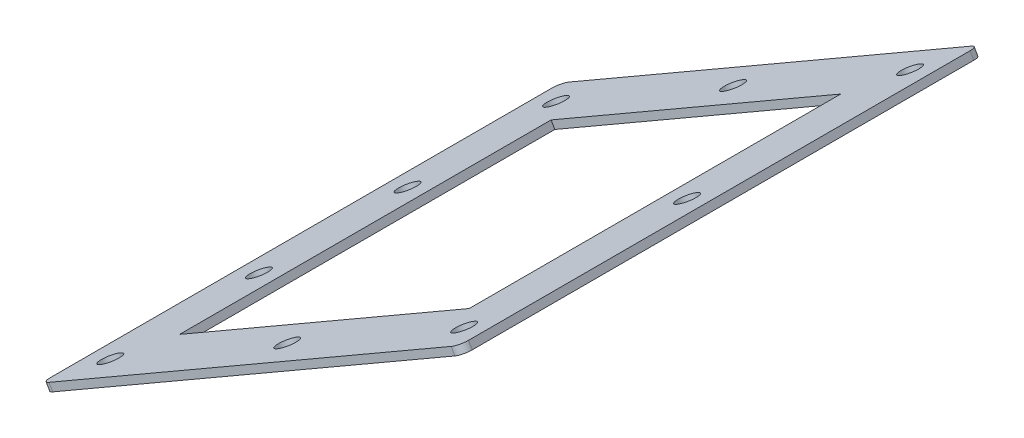
ISO-10303-21;
HEADER;
FILE_DESCRIPTION(('STEP AP214'),'2;1');
FILE_NAME('part.step','',(''),(''),'','','');
FILE_SCHEMA(('AUTOMOTIVE_DESIGN { 1 0 10303 214 1 1 1 1 }'));
ENDSEC;
DATA;
#1=APPLICATION_CONTEXT('core data for automotive mechanical design processes');
#2=APPLICATION_PROTOCOL_DEFINITION('international standard','automotive_design',2000,#1);
#3=PRODUCT_CONTEXT('',#1,'mechanical');
#4=PRODUCT('Part','Part','',(#3));
#5=PRODUCT_RELATED_PRODUCT_CATEGORY('part','',(#4));
#6=PRODUCT_DEFINITION_FORMATION('','',#4);
#7=PRODUCT_DEFINITION_CONTEXT('part definition',#1,'design');
#8=PRODUCT_DEFINITION('design','',#6,#7);
#9=PRODUCT_DEFINITION_SHAPE('','',#8);
#10=(LENGTH_UNIT() NAMED_UNIT(*) SI_UNIT(.MILLI.,.METRE.));
#11=(NAMED_UNIT(*) PLANE_ANGLE_UNIT() SI_UNIT($,.RADIAN.));
#12=(NAMED_UNIT(*) SI_UNIT($,.STERADIAN.) SOLID_ANGLE_UNIT());
#13=UNCERTAINTY_MEASURE_WITH_UNIT(LENGTH_MEASURE(1.E-05),#10,'distance_accuracy_value','');
#14=(GEOMETRIC_REPRESENTATION_CONTEXT(3) GLOBAL_UNCERTAINTY_ASSIGNED_CONTEXT((#13)) GLOBAL_UNIT_ASSIGNED_CONTEXT((#10,
#11,#12)) REPRESENTATION_CONTEXT('',''));
#15=CARTESIAN_POINT('',(0.,0.,0.));
#16=DIRECTION('',(0.,0.,1.));
#17=DIRECTION('',(1.,0.,0.));
#18=AXIS2_PLACEMENT_3D('',#15,#16,#17);
#19=CARTESIAN_POINT('',(-692.,3237.7,140.));
#20=DIRECTION('',(0.866025403784441,0.499999999999996,0.));
#21=DIRECTION('',(0.,0.,-1.));
#22=AXIS2_PLACEMENT_3D('',#19,#20,#21);
#23=PLANE('',#22);
#24=DIRECTION('',(0.,0.,1.));
#25=VECTOR('',#24,1.);
#26=CARTESIAN_POINT('',(-690.,3234.23589838486,140.));
#27=LINE('',#26,#25);
#28=CARTESIAN_POINT('',(-690.,3234.23589838486,135.));
#29=VERTEX_POINT('',#28);
#30=CARTESIAN_POINT('',(-690.,3234.23589838486,-135.));
#31=VERTEX_POINT('',#30);
#32=EDGE_CURVE('E222',#29,#31,#27,.F.);
#33=ORIENTED_EDGE('',*,*,#32,.F.);
#34=DIRECTION('',(-0.499999999999996,0.866025403784441,0.));
#35=VECTOR('',#34,1.);
#36=CARTESIAN_POINT('',(-692.,3237.7,135.));
#37=LINE('',#36,#35);
#38=CARTESIAN_POINT('',(-692.,3237.7,135.));
#39=VERTEX_POINT('',#38);
#40=EDGE_CURVE('E256',#29,#39,#37,.T.);
#41=ORIENTED_EDGE('',*,*,#40,.T.);
#42=DIRECTION('',(0.,0.,-1.));
#43=VECTOR('',#42,1.);
#44=CARTESIAN_POINT('',(-692.,3237.7,140.));
#45=LINE('',#44,#43);
#46=CARTESIAN_POINT('',(-692.,3237.7,-135.));
#47=VERTEX_POINT('',#46);
#48=EDGE_CURVE('E173',#39,#47,#45,.T.);
#49=ORIENTED_EDGE('',*,*,#48,.T.);
#50=DIRECTION('',(0.499999999999996,-0.866025403784441,0.));
#51=VECTOR('',#50,1.);
#52=CARTESIAN_POINT('',(-692.,3237.7,-135.));
#53=LINE('',#52,#51);
#54=EDGE_CURVE('E254',#47,#31,#53,.T.);
#55=ORIENTED_EDGE('',*,*,#54,.T.);
#56=EDGE_LOOP('',(#33,#41,#49,#55));
#57=FACE_BOUND('',#56,.T.);
#58=ADVANCED_FACE('F39',(#57),#23,.F.);
#59=CARTESIAN_POINT('',(-692.,3237.7,140.));
#60=DIRECTION('',(0.,0.,1.));
#61=DIRECTION('',(0.866025403784441,0.499999999999996,0.));
#62=AXIS2_PLACEMENT_3D('',#59,#60,#61);
#63=PLANE('',#62);
#64=DIRECTION('',(-0.866025403784441,-0.499999999999996,0.));
#65=VECTOR('',#64,1.);
#66=CARTESIAN_POINT('',(-690.,3234.23589838486,140.));
#67=LINE('',#66,#65);
#68=CARTESIAN_POINT('',(-685.669872981078,3236.73589838486,140.));
#69=VERTEX_POINT('',#68);
#70=CARTESIAN_POINT('',(-469.163522034964,3361.73589838486,140.));
#71=VERTEX_POINT('',#70);
#72=EDGE_CURVE('E218',#69,#71,#67,.F.);
#73=ORIENTED_EDGE('',*,*,#72,.T.);
#74=DIRECTION('',(-0.499999999999996,0.866025403784441,0.));
#75=VECTOR('',#74,1.);
#76=CARTESIAN_POINT('',(-471.163522034965,3365.2,140.));
#77=LINE('',#76,#75);
#78=CARTESIAN_POINT('',(-471.163522034965,3365.2,140.));
#79=VERTEX_POINT('',#78);
#80=EDGE_CURVE('E231',#71,#79,#77,.T.);
#81=ORIENTED_EDGE('',*,*,#80,.T.);
#82=DIRECTION('',(0.866025403784441,0.499999999999996,0.));
#83=VECTOR('',#82,1.);
#84=CARTESIAN_POINT('',(-692.,3237.7,140.));
#85=LINE('',#84,#83);
#86=CARTESIAN_POINT('',(-687.669872981078,3240.2,140.));
#87=VERTEX_POINT('',#86);
#88=EDGE_CURVE('E141',#87,#79,#85,.T.);
#89=ORIENTED_EDGE('',*,*,#88,.F.);
#90=DIRECTION('',(0.499999999999996,-0.866025403784441,0.));
#91=VECTOR('',#90,1.);
#92=CARTESIAN_POINT('',(-687.669872981078,3240.2,140.));
#93=LINE('',#92,#91);
#94=EDGE_CURVE('E228',#87,#69,#93,.T.);
#95=ORIENTED_EDGE('',*,*,#94,.T.);
#96=EDGE_LOOP('',(#73,#81,#89,#95));
#97=FACE_BOUND('',#96,.T.);
#98=ADVANCED_FACE('F286',(#97),#63,.T.);
#99=CARTESIAN_POINT('',(-466.833395016042,3367.7,140.));
#100=DIRECTION('',(0.866025403784441,0.499999999999996,0.));
#101=DIRECTION('',(0.,0.,-1.));
#102=AXIS2_PLACEMENT_3D('',#99,#100,#101);
#103=PLANE('',#102);
#104=DIRECTION('',(0.,0.,-1.));
#105=VECTOR('',#104,1.);
#106=CARTESIAN_POINT('',(-466.833395016042,3367.7,140.));
#107=LINE('',#106,#105);
#108=CARTESIAN_POINT('',(-466.833395016042,3367.7,135.));
#109=VERTEX_POINT('',#108);
#110=CARTESIAN_POINT('',(-466.833395016042,3367.7,-135.));
#111=VERTEX_POINT('',#110);
#112=EDGE_CURVE('E168',#109,#111,#107,.T.);
#113=ORIENTED_EDGE('',*,*,#112,.F.);
#114=DIRECTION('',(-0.499999999999996,0.866025403784441,0.));
#115=VECTOR('',#114,1.);
#116=CARTESIAN_POINT('',(-466.833395016042,3367.7,135.));
#117=LINE('',#116,#115);
#118=CARTESIAN_POINT('',(-464.833395016042,3364.23589838486,135.));
#119=VERTEX_POINT('',#118);
#120=EDGE_CURVE('E245',#109,#119,#117,.F.);
#121=ORIENTED_EDGE('',*,*,#120,.T.);
#122=DIRECTION('',(0.,0.,1.));
#123=VECTOR('',#122,1.);
#124=CARTESIAN_POINT('',(-464.833395016042,3364.23589838486,140.));
#125=LINE('',#124,#123);
#126=CARTESIAN_POINT('',(-464.833395016042,3364.23589838486,-135.));
#127=VERTEX_POINT('',#126);
#128=EDGE_CURVE('E214',#119,#127,#125,.F.);
#129=ORIENTED_EDGE('',*,*,#128,.T.);
#130=DIRECTION('',(0.499999999999996,-0.866025403784441,0.));
#131=VECTOR('',#130,1.);
#132=CARTESIAN_POINT('',(-466.833395016042,3367.7,-135.));
#133=LINE('',#132,#131);
#134=EDGE_CURVE('E242',#127,#111,#133,.F.);
#135=ORIENTED_EDGE('',*,*,#134,.T.);
#136=EDGE_LOOP('',(#113,#121,#129,#135));
#137=FACE_BOUND('',#136,.T.);
#138=ADVANCED_FACE('F279',(#137),#103,.T.);
#139=CARTESIAN_POINT('',(-501.474411167422,3347.7,-100.));
#140=DIRECTION('',(0.866025403784441,0.499999999999996,0.));
#141=DIRECTION('',(0.,0.,-1.));
#142=AXIS2_PLACEMENT_3D('',#139,#140,#141);
#143=PLANE('',#142);
#144=DIRECTION('',(-0.499999999999996,0.866025403784441,0.));
#145=VECTOR('',#144,1.);
#146=CARTESIAN_POINT('',(-501.474411167422,3347.7,-100.));
#147=LINE('',#146,#145);
#148=CARTESIAN_POINT('',(-499.474411167421,3344.23589838486,-100.));
#149=VERTEX_POINT('',#148);
#150=CARTESIAN_POINT('',(-501.474411167422,3347.7,-100.));
#151=VERTEX_POINT('',#150);
#152=EDGE_CURVE('E155',#149,#151,#147,.T.);
#153=ORIENTED_EDGE('',*,*,#152,.F.);
#154=DIRECTION('',(0.,0.,1.));
#155=VECTOR('',#154,1.);
#156=CARTESIAN_POINT('',(-499.474411167421,3344.23589838486,140.));
#157=LINE('',#156,#155);
#158=CARTESIAN_POINT('',(-499.474411167421,3344.23589838486,100.));
#159=VERTEX_POINT('',#158);
#160=EDGE_CURVE('E205',#159,#149,#157,.F.);
#161=ORIENTED_EDGE('',*,*,#160,.F.);
#162=DIRECTION('',(-0.499999999999996,0.866025403784441,0.));
#163=VECTOR('',#162,1.);
#164=CARTESIAN_POINT('',(-501.474411167422,3347.7,100.));
#165=LINE('',#164,#163);
#166=CARTESIAN_POINT('',(-501.474411167422,3347.7,100.));
#167=VERTEX_POINT('',#166);
#168=EDGE_CURVE('E226',#159,#167,#165,.T.);
#169=ORIENTED_EDGE('',*,*,#168,.T.);
#170=DIRECTION('',(0.,0.,-1.));
#171=VECTOR('',#170,1.);
#172=CARTESIAN_POINT('',(-501.474411167422,3347.7,-100.));
#173=LINE('',#172,#171);
#174=EDGE_CURVE('E156',#167,#151,#173,.T.);
#175=ORIENTED_EDGE('',*,*,#174,.T.);
#176=EDGE_LOOP('',(#153,#161,#169,#175));
#177=FACE_BOUND('',#176,.T.);
#178=ADVANCED_FACE('F325',(#177),#143,.F.);
#179=CARTESIAN_POINT('',(-657.358983848621,3257.7,100.));
#180=DIRECTION('',(0.,0.,1.));
#181=DIRECTION('',(0.86602540378444,0.499999999999997,0.));
#182=AXIS2_PLACEMENT_3D('',#179,#180,#181);
#183=PLANE('',#182);
#184=ORIENTED_EDGE('',*,*,#168,.F.);
#185=DIRECTION('',(-0.866025403784441,-0.499999999999996,0.));
#186=VECTOR('',#185,1.);
#187=CARTESIAN_POINT('',(-690.,3234.23589838486,100.));
#188=LINE('',#187,#186);
#189=CARTESIAN_POINT('',(-655.358983848621,3254.23589838486,100.));
#190=VERTEX_POINT('',#189);
#191=EDGE_CURVE('E201',#190,#159,#188,.F.);
#192=ORIENTED_EDGE('',*,*,#191,.F.);
#193=DIRECTION('',(-0.499999999999996,0.866025403784441,0.));
#194=VECTOR('',#193,1.);
#195=CARTESIAN_POINT('',(-657.358983848621,3257.7,100.));
#196=LINE('',#195,#194);
#197=CARTESIAN_POINT('',(-657.358983848621,3257.7,100.));
#198=VERTEX_POINT('',#197);
#199=EDGE_CURVE('E140',#190,#198,#196,.T.);
#200=ORIENTED_EDGE('',*,*,#199,.T.);
#201=DIRECTION('',(0.86602540378444,0.499999999999997,0.));
#202=VECTOR('',#201,1.);
#203=CARTESIAN_POINT('',(-657.358983848621,3257.7,100.));
#204=LINE('',#203,#202);
#205=EDGE_CURVE('E151',#198,#167,#204,.T.);
#206=ORIENTED_EDGE('',*,*,#205,.T.);
#207=EDGE_LOOP('',(#184,#192,#200,#206));
#208=FACE_BOUND('',#207,.T.);
#209=ADVANCED_FACE('F329',(#208),#183,.F.);
#210=CARTESIAN_POINT('',(-657.358983848621,3257.7,-100.));
#211=DIRECTION('',(-0.866025403784441,-0.499999999999996,0.));
#212=DIRECTION('',(0.,0.,1.));
#213=AXIS2_PLACEMENT_3D('',#210,#211,#212);
#214=PLANE('',#213);
#215=ORIENTED_EDGE('',*,*,#199,.F.);
#216=DIRECTION('',(0.,0.,1.));
#217=VECTOR('',#216,1.);
#218=CARTESIAN_POINT('',(-655.358983848621,3254.23589838486,140.));
#219=LINE('',#218,#217);
#220=CARTESIAN_POINT('',(-655.358983848621,3254.23589838486,-100.));
#221=VERTEX_POINT('',#220);
#222=EDGE_CURVE('E135',#221,#190,#219,.T.);
#223=ORIENTED_EDGE('',*,*,#222,.F.);
#224=DIRECTION('',(-0.499999999999996,0.866025403784441,0.));
#225=VECTOR('',#224,1.);
#226=CARTESIAN_POINT('',(-657.358983848621,3257.7,-100.));
#227=LINE('',#226,#225);
#228=CARTESIAN_POINT('',(-657.358983848621,3257.7,-100.));
#229=VERTEX_POINT('',#228);
#230=EDGE_CURVE('E129',#221,#229,#227,.T.);
#231=ORIENTED_EDGE('',*,*,#230,.T.);
#232=DIRECTION('',(0.,0.,1.));
#233=VECTOR('',#232,1.);
#234=CARTESIAN_POINT('',(-657.358983848621,3257.7,-100.));
#235=LINE('',#234,#233);
#236=EDGE_CURVE('E132',#229,#198,#235,.T.);
#237=ORIENTED_EDGE('',*,*,#236,.T.);
#238=EDGE_LOOP('',(#215,#223,#231,#237));
#239=FACE_BOUND('',#238,.T.);
#240=ADVANCED_FACE('F131',(#239),#214,.F.);
#241=CARTESIAN_POINT('',(-674.67949192431,3247.7,40.));
#242=DIRECTION('',(-0.499999999999996,0.866025403784441,0.));
#243=DIRECTION('',(-0.866025403784441,-0.499999999999996,0.));
#244=AXIS2_PLACEMENT_3D('',#241,#242,#243);
#245=CYLINDRICAL_SURFACE('',#244,5.5000000000001);
#246=CARTESIAN_POINT('',(-674.67949192431,3247.7,40.));
#247=DIRECTION('',(-0.499999999999996,0.866025403784441,0.));
#248=DIRECTION('',(0.866025403784441,0.499999999999996,0.));
#249=AXIS2_PLACEMENT_3D('',#246,#247,#248);
#250=CIRCLE('',#249,5.5000000000001);
#251=CARTESIAN_POINT('',(-669.916352203495,3250.45,40.));
#252=VERTEX_POINT('',#251);
#253=EDGE_CURVE('E221',#252,#252,#250,.T.);
#254=ORIENTED_EDGE('',*,*,#253,.T.);
#255=EDGE_LOOP('',(#254));
#256=FACE_BOUND('',#255,.T.);
#257=CARTESIAN_POINT('',(-672.67949192431,3244.23589838486,40.));
#258=DIRECTION('',(-0.499999999999996,0.866025403784441,0.));
#259=DIRECTION('',(-0.866025403784441,-0.499999999999996,0.));
#260=AXIS2_PLACEMENT_3D('',#257,#258,#259);
#261=CIRCLE('',#260,5.5000000000001);
#262=CARTESIAN_POINT('',(-677.442631645124,3241.48589838486,40.));
#263=VERTEX_POINT('',#262);
#264=EDGE_CURVE('E178',#263,#263,#261,.T.);
#265=ORIENTED_EDGE('',*,*,#264,.F.);
#266=EDGE_LOOP('',(#265));
#267=FACE_BOUND('',#266,.T.);
#268=ADVANCED_FACE('F356',(#256,#267),#245,.F.);
#269=CARTESIAN_POINT('',(-674.67949192431,3247.7,-40.));
#270=DIRECTION('',(-0.499999999999996,0.866025403784441,0.));
#271=DIRECTION('',(-0.866025403784441,-0.499999999999996,0.));
#272=AXIS2_PLACEMENT_3D('',#269,#270,#271);
#273=CYLINDRICAL_SURFACE('',#272,5.5000000000001);
#274=CARTESIAN_POINT('',(-674.67949192431,3247.7,-40.));
#275=DIRECTION('',(-0.499999999999996,0.866025403784441,0.));
#276=DIRECTION('',(-0.866025403784441,-0.499999999999996,0.));
#277=AXIS2_PLACEMENT_3D('',#274,#275,#276);
#278=CIRCLE('',#277,5.5000000000001);
#279=CARTESIAN_POINT('',(-679.442631645124,3244.95,-40.));
#280=VERTEX_POINT('',#279);
#281=EDGE_CURVE('E641',#280,#280,#278,.T.);
#282=ORIENTED_EDGE('',*,*,#281,.T.);
#283=EDGE_LOOP('',(#282));
#284=FACE_BOUND('',#283,.T.);
#285=CARTESIAN_POINT('',(-672.67949192431,3244.23589838486,-40.));
#286=DIRECTION('',(-0.499999999999996,0.866025403784441,0.));
#287=DIRECTION('',(-0.866025403784441,-0.499999999999996,0.));
#288=AXIS2_PLACEMENT_3D('',#285,#286,#287);
#289=CIRCLE('',#288,5.5000000000001);
#290=CARTESIAN_POINT('',(-677.442631645124,3241.48589838486,-40.));
#291=VERTEX_POINT('',#290);
#292=EDGE_CURVE('E181',#291,#291,#289,.T.);
#293=ORIENTED_EDGE('',*,*,#292,.F.);
#294=EDGE_LOOP('',(#293));
#295=FACE_BOUND('',#294,.T.);
#296=ADVANCED_FACE('F360',(#284,#295),#273,.F.);
#297=CARTESIAN_POINT('',(-674.67949192431,3247.7,120.));
#298=DIRECTION('',(-0.499999999999996,0.866025403784441,0.));
#299=DIRECTION('',(-0.866025403784441,-0.499999999999996,0.));
#300=AXIS2_PLACEMENT_3D('',#297,#298,#299);
#301=CYLINDRICAL_SURFACE('',#300,5.5000000000001);
#302=CARTESIAN_POINT('',(-674.67949192431,3247.7,120.));
#303=DIRECTION('',(-0.499999999999996,0.866025403784441,0.));
#304=DIRECTION('',(0.866025403784441,0.499999999999996,0.));
#305=AXIS2_PLACEMENT_3D('',#302,#303,#304);
#306=CIRCLE('',#305,5.5000000000001);
#307=CARTESIAN_POINT('',(-669.916352203495,3250.45,120.));
#308=VERTEX_POINT('',#307);
#309=EDGE_CURVE('E634',#308,#308,#306,.T.);
#310=ORIENTED_EDGE('',*,*,#309,.T.);
#311=EDGE_LOOP('',(#310));
#312=FACE_BOUND('',#311,.T.);
#313=CARTESIAN_POINT('',(-672.67949192431,3244.23589838486,120.));
#314=DIRECTION('',(-0.499999999999996,0.866025403784441,0.));
#315=DIRECTION('',(-0.866025403784441,-0.499999999999996,0.));
#316=AXIS2_PLACEMENT_3D('',#313,#314,#315);
#317=CIRCLE('',#316,5.5000000000001);
#318=CARTESIAN_POINT('',(-677.442631645124,3241.48589838486,120.));
#319=VERTEX_POINT('',#318);
#320=EDGE_CURVE('E184',#319,#319,#317,.T.);
#321=ORIENTED_EDGE('',*,*,#320,.F.);
#322=EDGE_LOOP('',(#321));
#323=FACE_BOUND('',#322,.T.);
#324=ADVANCED_FACE('F366',(#312,#323),#301,.F.);
#325=CARTESIAN_POINT('',(-579.416697508021,3302.7,120.));
#326=DIRECTION('',(-0.499999999999996,0.866025403784441,0.));
#327=DIRECTION('',(-0.866025403784441,-0.499999999999996,0.));
#328=AXIS2_PLACEMENT_3D('',#325,#326,#327);
#329=CYLINDRICAL_SURFACE('',#328,5.5000000000001);
#330=CARTESIAN_POINT('',(-579.416697508021,3302.7,120.));
#331=DIRECTION('',(-0.499999999999996,0.866025403784441,0.));
#332=DIRECTION('',(0.866025403784441,0.499999999999996,0.));
#333=AXIS2_PLACEMENT_3D('',#330,#331,#332);
#334=CIRCLE('',#333,5.5000000000001);
#335=CARTESIAN_POINT('',(-574.653557787207,3305.45,120.));
#336=VERTEX_POINT('',#335);
#337=EDGE_CURVE('E629',#336,#336,#334,.T.);
#338=ORIENTED_EDGE('',*,*,#337,.T.);
#339=EDGE_LOOP('',(#338));
#340=FACE_BOUND('',#339,.T.);
#341=CARTESIAN_POINT('',(-577.416697508021,3299.23589838486,120.));
#342=DIRECTION('',(-0.499999999999996,0.866025403784441,0.));
#343=DIRECTION('',(-0.866025403784441,-0.499999999999996,0.));
#344=AXIS2_PLACEMENT_3D('',#341,#342,#343);
#345=CIRCLE('',#344,5.5000000000001);
#346=CARTESIAN_POINT('',(-582.179837228836,3296.48589838486,120.));
#347=VERTEX_POINT('',#346);
#348=EDGE_CURVE('E187',#347,#347,#345,.T.);
#349=ORIENTED_EDGE('',*,*,#348,.F.);
#350=EDGE_LOOP('',(#349));
#351=FACE_BOUND('',#350,.T.);
#352=ADVANCED_FACE('F375',(#340,#351),#329,.F.);
#353=CARTESIAN_POINT('',(-484.153903091733,3357.7,120.));
#354=DIRECTION('',(-0.499999999999996,0.866025403784441,0.));
#355=DIRECTION('',(-0.866025403784441,-0.499999999999996,0.));
#356=AXIS2_PLACEMENT_3D('',#353,#354,#355);
#357=CYLINDRICAL_SURFACE('',#356,5.5);
#358=CARTESIAN_POINT('',(-484.153903091733,3357.7,120.));
#359=DIRECTION('',(-0.499999999999996,0.866025403784441,0.));
#360=DIRECTION('',(-0.866025403784441,-0.499999999999996,0.));
#361=AXIS2_PLACEMENT_3D('',#358,#359,#360);
#362=CIRCLE('',#361,5.5);
#363=CARTESIAN_POINT('',(-488.917042812547,3354.95,120.));
#364=VERTEX_POINT('',#363);
#365=EDGE_CURVE('E386',#364,#364,#362,.T.);
#366=ORIENTED_EDGE('',*,*,#365,.T.);
#367=EDGE_LOOP('',(#366));
#368=FACE_BOUND('',#367,.T.);
#369=CARTESIAN_POINT('',(-482.153903091733,3354.23589838486,120.));
#370=DIRECTION('',(-0.499999999999996,0.866025403784441,0.));
#371=DIRECTION('',(-0.866025403784441,-0.499999999999996,0.));
#372=AXIS2_PLACEMENT_3D('',#369,#370,#371);
#373=CIRCLE('',#372,5.5);
#374=CARTESIAN_POINT('',(-486.917042812547,3351.48589838486,120.));
#375=VERTEX_POINT('',#374);
#376=EDGE_CURVE('E190',#375,#375,#373,.T.);
#377=ORIENTED_EDGE('',*,*,#376,.F.);
#378=EDGE_LOOP('',(#377));
#379=FACE_BOUND('',#378,.T.);
#380=ADVANCED_FACE('F349',(#368,#379),#357,.F.);
#381=CARTESIAN_POINT('',(-484.153903091733,3357.7,-120.));
#382=DIRECTION('',(-0.499999999999996,0.866025403784441,0.));
#383=DIRECTION('',(-0.866025403784441,-0.499999999999996,0.));
#384=AXIS2_PLACEMENT_3D('',#381,#382,#383);
#385=CYLINDRICAL_SURFACE('',#384,5.5);
#386=CARTESIAN_POINT('',(-484.153903091733,3357.7,-120.));
#387=DIRECTION('',(-0.499999999999996,0.866025403784441,0.));
#388=DIRECTION('',(0.866025403784441,0.499999999999996,0.));
#389=AXIS2_PLACEMENT_3D('',#386,#387,#388);
#390=CIRCLE('',#389,5.5);
#391=CARTESIAN_POINT('',(-479.390763370918,3360.45,-120.));
#392=VERTEX_POINT('',#391);
#393=EDGE_CURVE('E628',#392,#392,#390,.T.);
#394=ORIENTED_EDGE('',*,*,#393,.T.);
#395=EDGE_LOOP('',(#394));
#396=FACE_BOUND('',#395,.T.);
#397=CARTESIAN_POINT('',(-482.153903091733,3354.23589838486,-120.));
#398=DIRECTION('',(-0.499999999999996,0.866025403784441,0.));
#399=DIRECTION('',(-0.866025403784441,-0.499999999999996,0.));
#400=AXIS2_PLACEMENT_3D('',#397,#398,#399);
#401=CIRCLE('',#400,5.5);
#402=CARTESIAN_POINT('',(-486.917042812547,3351.48589838486,-120.));
#403=VERTEX_POINT('',#402);
#404=EDGE_CURVE('E193',#403,#403,#401,.T.);
#405=ORIENTED_EDGE('',*,*,#404,.F.);
#406=EDGE_LOOP('',(#405));
#407=FACE_BOUND('',#406,.T.);
#408=ADVANCED_FACE('F343',(#396,#407),#385,.F.);
#409=CARTESIAN_POINT('',(-484.153903091733,3357.7,0.));
#410=DIRECTION('',(-0.499999999999996,0.866025403784441,0.));
#411=DIRECTION('',(-0.866025403784441,-0.499999999999996,0.));
#412=AXIS2_PLACEMENT_3D('',#409,#410,#411);
#413=CYLINDRICAL_SURFACE('',#412,5.49999999999979);
#414=CARTESIAN_POINT('',(-484.153903091733,3357.7,0.));
#415=DIRECTION('',(-0.499999999999996,0.866025403784441,0.));
#416=DIRECTION('',(0.866025403784441,0.499999999999996,0.));
#417=AXIS2_PLACEMENT_3D('',#414,#415,#416);
#418=CIRCLE('',#417,5.49999999999979);
#419=CARTESIAN_POINT('',(-479.390763370918,3360.45,0.));
#420=VERTEX_POINT('',#419);
#421=EDGE_CURVE('E152',#420,#420,#418,.T.);
#422=ORIENTED_EDGE('',*,*,#421,.T.);
#423=EDGE_LOOP('',(#422));
#424=FACE_BOUND('',#423,.T.);
#425=CARTESIAN_POINT('',(-482.153903091733,3354.23589838486,0.));
#426=DIRECTION('',(-0.499999999999996,0.866025403784441,0.));
#427=DIRECTION('',(-0.866025403784441,-0.499999999999996,0.));
#428=AXIS2_PLACEMENT_3D('',#425,#426,#427);
#429=CIRCLE('',#428,5.49999999999979);
#430=CARTESIAN_POINT('',(-486.917042812547,3351.48589838486,0.));
#431=VERTEX_POINT('',#430);
#432=EDGE_CURVE('E196',#431,#431,#429,.T.);
#433=ORIENTED_EDGE('',*,*,#432,.F.);
#434=EDGE_LOOP('',(#433));
#435=FACE_BOUND('',#434,.T.);
#436=ADVANCED_FACE('F339',(#424,#435),#413,.F.);
#437=CARTESIAN_POINT('',(-657.358983848621,3257.7,-100.));
#438=DIRECTION('',(0.,0.,-1.));
#439=DIRECTION('',(-0.86602540378444,-0.499999999999997,0.));
#440=AXIS2_PLACEMENT_3D('',#437,#438,#439);
#441=PLANE('',#440);
#442=DIRECTION('',(-0.866025403784441,-0.499999999999996,0.));
#443=VECTOR('',#442,1.);
#444=CARTESIAN_POINT('',(-690.,3234.23589838486,-100.));
#445=LINE('',#444,#443);
#446=EDGE_CURVE('E200',#149,#221,#445,.T.);
#447=ORIENTED_EDGE('',*,*,#446,.F.);
#448=ORIENTED_EDGE('',*,*,#152,.T.);
#449=DIRECTION('',(-0.86602540378444,-0.499999999999997,0.));
#450=VECTOR('',#449,1.);
#451=CARTESIAN_POINT('',(-657.358983848621,3257.7,-100.));
#452=LINE('',#451,#450);
#453=EDGE_CURVE('E148',#151,#229,#452,.T.);
#454=ORIENTED_EDGE('',*,*,#453,.T.);
#455=ORIENTED_EDGE('',*,*,#230,.F.);
#456=EDGE_LOOP('',(#447,#448,#454,#455));
#457=FACE_BOUND('',#456,.T.);
#458=ADVANCED_FACE('F154',(#457),#441,.F.);
#459=CARTESIAN_POINT('',(-579.416697508021,3302.7,-120.));
#460=DIRECTION('',(-0.499999999999996,0.866025403784441,0.));
#461=DIRECTION('',(-0.866025403784441,-0.499999999999996,0.));
#462=AXIS2_PLACEMENT_3D('',#459,#460,#461);
#463=CYLINDRICAL_SURFACE('',#462,5.5000000000001);
#464=CARTESIAN_POINT('',(-579.416697508021,3302.7,-120.));
#465=DIRECTION('',(-0.499999999999996,0.866025403784441,0.));
#466=DIRECTION('',(-0.866025403784441,-0.499999999999996,0.));
#467=AXIS2_PLACEMENT_3D('',#464,#465,#466);
#468=CIRCLE('',#467,5.5000000000001);
#469=CARTESIAN_POINT('',(-584.179837228836,3299.95,-120.));
#470=VERTEX_POINT('',#469);
#471=EDGE_CURVE('E162',#470,#470,#468,.T.);
#472=ORIENTED_EDGE('',*,*,#471,.T.);
#473=EDGE_LOOP('',(#472));
#474=FACE_BOUND('',#473,.T.);
#475=CARTESIAN_POINT('',(-577.416697508021,3299.23589838486,-120.));
#476=DIRECTION('',(-0.499999999999996,0.866025403784441,0.));
#477=DIRECTION('',(-0.866025403784441,-0.499999999999996,0.));
#478=AXIS2_PLACEMENT_3D('',#475,#476,#477);
#479=CIRCLE('',#478,5.5000000000001);
#480=CARTESIAN_POINT('',(-582.179837228836,3296.48589838486,-120.));
#481=VERTEX_POINT('',#480);
#482=EDGE_CURVE('E204',#481,#481,#479,.T.);
#483=ORIENTED_EDGE('',*,*,#482,.F.);
#484=EDGE_LOOP('',(#483));
#485=FACE_BOUND('',#484,.T.);
#486=ADVANCED_FACE('F314',(#474,#485),#463,.F.);
#487=CARTESIAN_POINT('',(-674.67949192431,3247.7,-120.));
#488=DIRECTION('',(-0.499999999999996,0.866025403784441,0.));
#489=DIRECTION('',(-0.866025403784441,-0.499999999999996,0.));
#490=AXIS2_PLACEMENT_3D('',#487,#488,#489);
#491=CYLINDRICAL_SURFACE('',#490,5.5000000000001);
#492=CARTESIAN_POINT('',(-674.67949192431,3247.7,-120.));
#493=DIRECTION('',(-0.499999999999996,0.866025403784441,0.));
#494=DIRECTION('',(-0.866025403784441,-0.499999999999996,0.));
#495=AXIS2_PLACEMENT_3D('',#492,#493,#494);
#496=CIRCLE('',#495,5.5000000000001);
#497=CARTESIAN_POINT('',(-679.442631645124,3244.95,-120.));
#498=VERTEX_POINT('',#497);
#499=EDGE_CURVE('E165',#498,#498,#496,.T.);
#500=ORIENTED_EDGE('',*,*,#499,.T.);
#501=EDGE_LOOP('',(#500));
#502=FACE_BOUND('',#501,.T.);
#503=CARTESIAN_POINT('',(-672.67949192431,3244.23589838486,-120.));
#504=DIRECTION('',(-0.499999999999996,0.866025403784441,0.));
#505=DIRECTION('',(-0.866025403784441,-0.499999999999996,0.));
#506=AXIS2_PLACEMENT_3D('',#503,#504,#505);
#507=CIRCLE('',#506,5.5000000000001);
#508=CARTESIAN_POINT('',(-677.442631645124,3241.48589838486,-120.));
#509=VERTEX_POINT('',#508);
#510=EDGE_CURVE('E211',#509,#509,#507,.T.);
#511=ORIENTED_EDGE('',*,*,#510,.F.);
#512=EDGE_LOOP('',(#511));
#513=FACE_BOUND('',#512,.T.);
#514=ADVANCED_FACE('F307',(#502,#513),#491,.F.);
#515=CARTESIAN_POINT('',(-692.,3237.7,-140.));
#516=DIRECTION('',(0.,0.,1.));
#517=DIRECTION('',(0.866025403784441,0.499999999999996,0.));
#518=AXIS2_PLACEMENT_3D('',#515,#516,#517);
#519=PLANE('',#518);
#520=DIRECTION('',(-0.866025403784441,-0.499999999999996,0.));
#521=VECTOR('',#520,1.);
#522=CARTESIAN_POINT('',(-690.,3234.23589838486,-140.));
#523=LINE('',#522,#521);
#524=CARTESIAN_POINT('',(-685.669872981078,3236.73589838486,-140.));
#525=VERTEX_POINT('',#524);
#526=CARTESIAN_POINT('',(-469.163522034964,3361.73589838486,-140.));
#527=VERTEX_POINT('',#526);
#528=EDGE_CURVE('E217',#525,#527,#523,.F.);
#529=ORIENTED_EDGE('',*,*,#528,.F.);
#530=DIRECTION('',(0.499999999999996,-0.866025403784441,0.));
#531=VECTOR('',#530,1.);
#532=CARTESIAN_POINT('',(-687.669872981078,3240.2,-140.));
#533=LINE('',#532,#531);
#534=CARTESIAN_POINT('',(-687.669872981078,3240.2,-140.));
#535=VERTEX_POINT('',#534);
#536=EDGE_CURVE('E11',#525,#535,#533,.F.);
#537=ORIENTED_EDGE('',*,*,#536,.T.);
#538=DIRECTION('',(0.866025403784441,0.499999999999996,0.));
#539=VECTOR('',#538,1.);
#540=CARTESIAN_POINT('',(-692.,3237.7,-140.));
#541=LINE('',#540,#539);
#542=CARTESIAN_POINT('',(-471.163522034965,3365.2,-140.));
#543=VERTEX_POINT('',#542);
#544=EDGE_CURVE('E171',#535,#543,#541,.T.);
#545=ORIENTED_EDGE('',*,*,#544,.T.);
#546=DIRECTION('',(-0.499999999999996,0.866025403784441,0.));
#547=VECTOR('',#546,1.);
#548=CARTESIAN_POINT('',(-471.163522034965,3365.2,-140.));
#549=LINE('',#548,#547);
#550=EDGE_CURVE('E47',#543,#527,#549,.F.);
#551=ORIENTED_EDGE('',*,*,#550,.T.);
#552=EDGE_LOOP('',(#529,#537,#545,#551));
#553=FACE_BOUND('',#552,.T.);
#554=ADVANCED_FACE('F271',(#553),#519,.F.);
#555=CARTESIAN_POINT('',(-692.,3237.7,140.));
#556=DIRECTION('',(-0.499999999999996,0.866025403784441,0.));
#557=DIRECTION('',(-0.866025403784441,-0.499999999999996,0.));
#558=AXIS2_PLACEMENT_3D('',#555,#556,#557);
#559=PLANE('',#558);
#560=ORIENTED_EDGE('',*,*,#253,.F.);
#561=EDGE_LOOP('',(#560));
#562=FACE_BOUND('',#561,.T.);
#563=ORIENTED_EDGE('',*,*,#281,.F.);
#564=EDGE_LOOP('',(#563));
#565=FACE_BOUND('',#564,.T.);
#566=ORIENTED_EDGE('',*,*,#309,.F.);
#567=EDGE_LOOP('',(#566));
#568=FACE_BOUND('',#567,.T.);
#569=ORIENTED_EDGE('',*,*,#337,.F.);
#570=EDGE_LOOP('',(#569));
#571=FACE_BOUND('',#570,.T.);
#572=ORIENTED_EDGE('',*,*,#365,.F.);
#573=EDGE_LOOP('',(#572));
#574=FACE_BOUND('',#573,.T.);
#575=ORIENTED_EDGE('',*,*,#393,.F.);
#576=EDGE_LOOP('',(#575));
#577=FACE_BOUND('',#576,.T.);
#578=ORIENTED_EDGE('',*,*,#421,.F.);
#579=EDGE_LOOP('',(#578));
#580=FACE_BOUND('',#579,.T.);
#581=ORIENTED_EDGE('',*,*,#236,.F.);
#582=ORIENTED_EDGE('',*,*,#453,.F.);
#583=ORIENTED_EDGE('',*,*,#174,.F.);
#584=ORIENTED_EDGE('',*,*,#205,.F.);
#585=EDGE_LOOP('',(#581,#582,#583,#584));
#586=FACE_BOUND('',#585,.T.);
#587=ORIENTED_EDGE('',*,*,#471,.F.);
#588=EDGE_LOOP('',(#587));
#589=FACE_BOUND('',#588,.T.);
#590=ORIENTED_EDGE('',*,*,#499,.F.);
#591=EDGE_LOOP('',(#590));
#592=FACE_BOUND('',#591,.T.);
#593=ORIENTED_EDGE('',*,*,#88,.T.);
#594=CARTESIAN_POINT('',(-471.163522034965,3365.2,135.));
#595=DIRECTION('',(-0.499999999999996,0.866025403784441,0.));
#596=DIRECTION('',(-0.866025403784441,-0.499999999999996,0.));
#597=AXIS2_PLACEMENT_3D('',#594,#595,#596);
#598=CIRCLE('',#597,5.);
#599=EDGE_CURVE('E240',#79,#109,#598,.T.);
#600=ORIENTED_EDGE('',*,*,#599,.T.);
#601=ORIENTED_EDGE('',*,*,#112,.T.);
#602=CARTESIAN_POINT('',(-471.163522034965,3365.2,-135.));
#603=DIRECTION('',(-0.499999999999996,0.866025403784441,0.));
#604=DIRECTION('',(-0.866025403784441,-0.499999999999996,0.));
#605=AXIS2_PLACEMENT_3D('',#602,#603,#604);
#606=CIRCLE('',#605,5.);
#607=EDGE_CURVE('E234',#111,#543,#606,.T.);
#608=ORIENTED_EDGE('',*,*,#607,.T.);
#609=ORIENTED_EDGE('',*,*,#544,.F.);
#610=CARTESIAN_POINT('',(-687.669872981078,3240.2,-135.));
#611=DIRECTION('',(-0.499999999999996,0.866025403784441,0.));
#612=DIRECTION('',(-0.866025403784441,-0.499999999999996,0.));
#613=AXIS2_PLACEMENT_3D('',#610,#611,#612);
#614=CIRCLE('',#613,5.);
#615=EDGE_CURVE('E236',#535,#47,#614,.T.);
#616=ORIENTED_EDGE('',*,*,#615,.T.);
#617=ORIENTED_EDGE('',*,*,#48,.F.);
#618=CARTESIAN_POINT('',(-687.669872981078,3240.2,135.));
#619=DIRECTION('',(-0.499999999999996,0.866025403784441,0.));
#620=DIRECTION('',(-0.866025403784441,-0.499999999999996,0.));
#621=AXIS2_PLACEMENT_3D('',#618,#619,#620);
#622=CIRCLE('',#621,5.);
#623=EDGE_CURVE('E238',#39,#87,#622,.T.);
#624=ORIENTED_EDGE('',*,*,#623,.T.);
#625=EDGE_LOOP('',(#593,#600,#601,#608,#609,#616,#617,#624));
#626=FACE_BOUND('',#625,.T.);
#627=ADVANCED_FACE('F145',(#562,#565,#568,#571,#574,#577,#580,#586,#589,#592,#626),#559,.T.);
#628=CARTESIAN_POINT('',(-690.,3234.23589838486,140.));
#629=DIRECTION('',(-0.499999999999996,0.866025403784441,0.));
#630=DIRECTION('',(-0.866025403784441,-0.499999999999996,0.));
#631=AXIS2_PLACEMENT_3D('',#628,#629,#630);
#632=PLANE('',#631);
#633=ORIENTED_EDGE('',*,*,#264,.T.);
#634=EDGE_LOOP('',(#633));
#635=FACE_BOUND('',#634,.T.);
#636=ORIENTED_EDGE('',*,*,#292,.T.);
#637=EDGE_LOOP('',(#636));
#638=FACE_BOUND('',#637,.T.);
#639=ORIENTED_EDGE('',*,*,#320,.T.);
#640=EDGE_LOOP('',(#639));
#641=FACE_BOUND('',#640,.T.);
#642=ORIENTED_EDGE('',*,*,#348,.T.);
#643=EDGE_LOOP('',(#642));
#644=FACE_BOUND('',#643,.T.);
#645=ORIENTED_EDGE('',*,*,#376,.T.);
#646=EDGE_LOOP('',(#645));
#647=FACE_BOUND('',#646,.T.);
#648=ORIENTED_EDGE('',*,*,#404,.T.);
#649=EDGE_LOOP('',(#648));
#650=FACE_BOUND('',#649,.T.);
#651=ORIENTED_EDGE('',*,*,#432,.T.);
#652=EDGE_LOOP('',(#651));
#653=FACE_BOUND('',#652,.T.);
#654=ORIENTED_EDGE('',*,*,#222,.T.);
#655=ORIENTED_EDGE('',*,*,#191,.T.);
#656=ORIENTED_EDGE('',*,*,#160,.T.);
#657=ORIENTED_EDGE('',*,*,#446,.T.);
#658=EDGE_LOOP('',(#654,#655,#656,#657));
#659=FACE_BOUND('',#658,.T.);
#660=ORIENTED_EDGE('',*,*,#482,.T.);
#661=EDGE_LOOP('',(#660));
#662=FACE_BOUND('',#661,.T.);
#663=ORIENTED_EDGE('',*,*,#510,.T.);
#664=EDGE_LOOP('',(#663));
#665=FACE_BOUND('',#664,.T.);
#666=ORIENTED_EDGE('',*,*,#128,.F.);
#667=CARTESIAN_POINT('',(-469.163522034965,3361.73589838486,135.));
#668=DIRECTION('',(-0.499999999999996,0.866025403784441,0.));
#669=DIRECTION('',(-0.866025403784441,-0.499999999999996,0.));
#670=AXIS2_PLACEMENT_3D('',#667,#668,#669);
#671=CIRCLE('',#670,5.);
#672=EDGE_CURVE('E252',#119,#71,#671,.F.);
#673=ORIENTED_EDGE('',*,*,#672,.T.);
#674=ORIENTED_EDGE('',*,*,#72,.F.);
#675=CARTESIAN_POINT('',(-685.669872981078,3236.73589838486,135.));
#676=DIRECTION('',(-0.499999999999996,0.866025403784441,0.));
#677=DIRECTION('',(-0.866025403784441,-0.499999999999996,0.));
#678=AXIS2_PLACEMENT_3D('',#675,#676,#677);
#679=CIRCLE('',#678,5.);
#680=EDGE_CURVE('E250',#69,#29,#679,.F.);
#681=ORIENTED_EDGE('',*,*,#680,.T.);
#682=ORIENTED_EDGE('',*,*,#32,.T.);
#683=CARTESIAN_POINT('',(-685.669872981078,3236.73589838486,-135.));
#684=DIRECTION('',(-0.499999999999996,0.866025403784441,0.));
#685=DIRECTION('',(-0.866025403784441,-0.499999999999996,0.));
#686=AXIS2_PLACEMENT_3D('',#683,#684,#685);
#687=CIRCLE('',#686,5.);
#688=EDGE_CURVE('E60',#31,#525,#687,.F.);
#689=ORIENTED_EDGE('',*,*,#688,.T.);
#690=ORIENTED_EDGE('',*,*,#528,.T.);
#691=CARTESIAN_POINT('',(-469.163522034965,3361.73589838486,-135.));
#692=DIRECTION('',(-0.499999999999996,0.866025403784441,0.));
#693=DIRECTION('',(-0.866025403784441,-0.499999999999996,0.));
#694=AXIS2_PLACEMENT_3D('',#691,#692,#693);
#695=CIRCLE('',#694,5.);
#696=EDGE_CURVE('E247',#527,#127,#695,.F.);
#697=ORIENTED_EDGE('',*,*,#696,.T.);
#698=EDGE_LOOP('',(#666,#673,#674,#681,#682,#689,#690,#697));
#699=FACE_BOUND('',#698,.T.);
#700=ADVANCED_FACE('F274',(#635,#638,#641,#644,#647,#650,#653,#659,#662,#665,#699),#632,.F.);
#701=CARTESIAN_POINT('',(-471.163522034965,3365.2,135.));
#702=DIRECTION('',(-0.499999999999996,0.866025403784441,0.));
#703=DIRECTION('',(-0.866025403784441,-0.499999999999996,0.));
#704=AXIS2_PLACEMENT_3D('',#701,#702,#703);
#705=CYLINDRICAL_SURFACE('',#704,5.);
#706=ORIENTED_EDGE('',*,*,#672,.F.);
#707=ORIENTED_EDGE('',*,*,#120,.F.);
#708=ORIENTED_EDGE('',*,*,#599,.F.);
#709=ORIENTED_EDGE('',*,*,#80,.F.);
#710=EDGE_LOOP('',(#706,#707,#708,#709));
#711=FACE_BOUND('',#710,.T.);
#712=ADVANCED_FACE('F284',(#711),#705,.T.);
#713=CARTESIAN_POINT('',(-687.669872981078,3240.2,135.));
#714=DIRECTION('',(0.499999999999996,-0.866025403784441,0.));
#715=DIRECTION('',(0.866025403784441,0.499999999999996,0.));
#716=AXIS2_PLACEMENT_3D('',#713,#714,#715);
#717=CYLINDRICAL_SURFACE('',#716,5.);
#718=ORIENTED_EDGE('',*,*,#680,.F.);
#719=ORIENTED_EDGE('',*,*,#94,.F.);
#720=ORIENTED_EDGE('',*,*,#623,.F.);
#721=ORIENTED_EDGE('',*,*,#40,.F.);
#722=EDGE_LOOP('',(#718,#719,#720,#721));
#723=FACE_BOUND('',#722,.T.);
#724=ADVANCED_FACE('F289',(#723),#717,.T.);
#725=CARTESIAN_POINT('',(-687.669872981078,3240.2,-135.));
#726=DIRECTION('',(-0.499999999999996,0.866025403784441,0.));
#727=DIRECTION('',(-0.866025403784441,-0.499999999999996,0.));
#728=AXIS2_PLACEMENT_3D('',#725,#726,#727);
#729=CYLINDRICAL_SURFACE('',#728,5.);
#730=ORIENTED_EDGE('',*,*,#688,.F.);
#731=ORIENTED_EDGE('',*,*,#54,.F.);
#732=ORIENTED_EDGE('',*,*,#615,.F.);
#733=ORIENTED_EDGE('',*,*,#536,.F.);
#734=EDGE_LOOP('',(#730,#731,#732,#733));
#735=FACE_BOUND('',#734,.T.);
#736=ADVANCED_FACE('F270',(#735),#729,.T.);
#737=CARTESIAN_POINT('',(-471.163522034965,3365.2,-135.));
#738=DIRECTION('',(0.499999999999996,-0.866025403784441,0.));
#739=DIRECTION('',(0.866025403784441,0.499999999999996,0.));
#740=AXIS2_PLACEMENT_3D('',#737,#738,#739);
#741=CYLINDRICAL_SURFACE('',#740,5.);
#742=ORIENTED_EDGE('',*,*,#696,.F.);
#743=ORIENTED_EDGE('',*,*,#550,.F.);
#744=ORIENTED_EDGE('',*,*,#607,.F.);
#745=ORIENTED_EDGE('',*,*,#134,.F.);
#746=EDGE_LOOP('',(#742,#743,#744,#745));
#747=FACE_BOUND('',#746,.T.);
#748=ADVANCED_FACE('F41',(#747),#741,.T.);
#749=CLOSED_SHELL('',(#58,#98,#138,#178,#209,#240,#268,#296,#324,#352,#380,#408,#436,#458,#486,
#514,#554,#627,#700,#712,#724,#736,#748));
#750=MANIFOLD_SOLID_BREP('B2',#749);
#751=ADVANCED_BREP_SHAPE_REPRESENTATION('',(#18,#750),#14);
#752=SHAPE_DEFINITION_REPRESENTATION(#9,#751);
ENDSEC;
END-ISO-10303-21;
